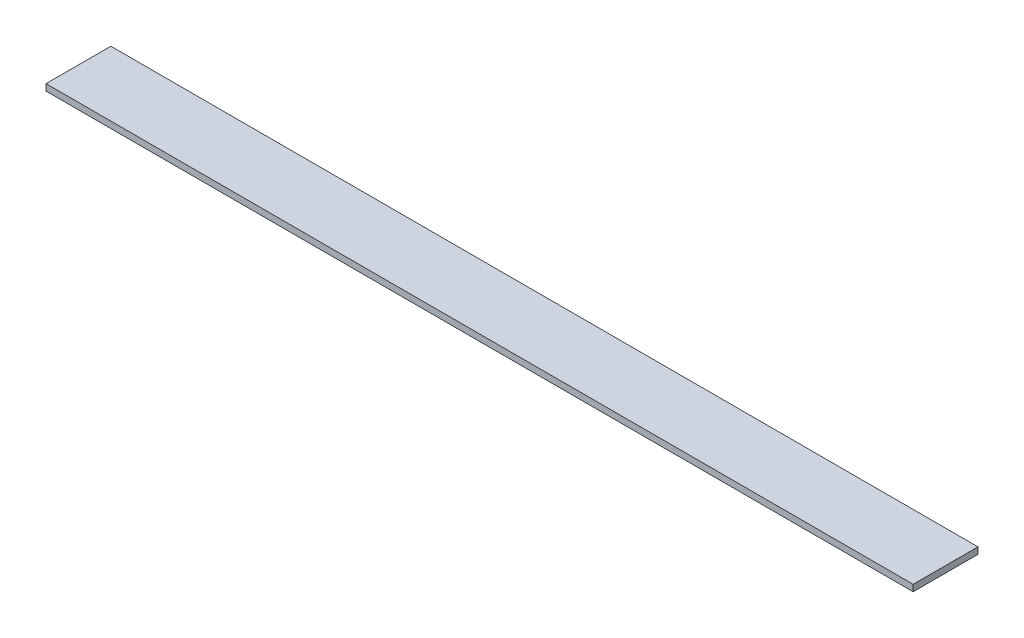
ISO-10303-21;
HEADER;
FILE_DESCRIPTION(('STEP AP214'),'2;1');
FILE_NAME('part.step','',(''),(''),'','','');
FILE_SCHEMA(('AUTOMOTIVE_DESIGN { 1 0 10303 214 1 1 1 1 }'));
ENDSEC;
DATA;
#1=APPLICATION_CONTEXT('core data for automotive mechanical design processes');
#2=APPLICATION_PROTOCOL_DEFINITION('international standard','automotive_design',2000,#1);
#3=PRODUCT_CONTEXT('',#1,'mechanical');
#4=PRODUCT('Part','Part','',(#3));
#5=PRODUCT_RELATED_PRODUCT_CATEGORY('part','',(#4));
#6=PRODUCT_DEFINITION_FORMATION('','',#4);
#7=PRODUCT_DEFINITION_CONTEXT('part definition',#1,'design');
#8=PRODUCT_DEFINITION('design','',#6,#7);
#9=PRODUCT_DEFINITION_SHAPE('','',#8);
#10=(LENGTH_UNIT() NAMED_UNIT(*) SI_UNIT(.MILLI.,.METRE.));
#11=(NAMED_UNIT(*) PLANE_ANGLE_UNIT() SI_UNIT($,.RADIAN.));
#12=(NAMED_UNIT(*) SI_UNIT($,.STERADIAN.) SOLID_ANGLE_UNIT());
#13=UNCERTAINTY_MEASURE_WITH_UNIT(LENGTH_MEASURE(1.E-05),#10,'distance_accuracy_value','');
#14=(GEOMETRIC_REPRESENTATION_CONTEXT(3) GLOBAL_UNCERTAINTY_ASSIGNED_CONTEXT((#13)) GLOBAL_UNIT_ASSIGNED_CONTEXT((#10,
#11,#12)) REPRESENTATION_CONTEXT('',''));
#15=CARTESIAN_POINT('',(0.,0.,0.));
#16=DIRECTION('',(0.,0.,1.));
#17=DIRECTION('',(1.,0.,0.));
#18=AXIS2_PLACEMENT_3D('',#15,#16,#17);
#19=CARTESIAN_POINT('',(1070.,0.,40.));
#20=DIRECTION('',(0.,0.,-1.));
#21=DIRECTION('',(-1.,0.,0.));
#22=AXIS2_PLACEMENT_3D('',#19,#20,#21);
#23=PLANE('',#22);
#24=DIRECTION('',(0.,-1.,0.));
#25=VECTOR('',#24,1.);
#26=CARTESIAN_POINT('',(0.,0.,40.));
#27=LINE('',#26,#25);
#28=CARTESIAN_POINT('',(0.,8.,40.));
#29=VERTEX_POINT('',#28);
#30=CARTESIAN_POINT('',(0.,0.,40.));
#31=VERTEX_POINT('',#30);
#32=EDGE_CURVE('E100',#29,#31,#27,.T.);
#33=ORIENTED_EDGE('',*,*,#32,.T.);
#34=DIRECTION('',(-1.,0.,0.));
#35=VECTOR('',#34,1.);
#36=CARTESIAN_POINT('',(1070.,0.,40.));
#37=LINE('',#36,#35);
#38=CARTESIAN_POINT('',(1070.,0.,40.));
#39=VERTEX_POINT('',#38);
#40=EDGE_CURVE('E11',#39,#31,#37,.T.);
#41=ORIENTED_EDGE('',*,*,#40,.F.);
#42=DIRECTION('',(0.,-1.,0.));
#43=VECTOR('',#42,1.);
#44=CARTESIAN_POINT('',(1070.,0.,40.));
#45=LINE('',#44,#43);
#46=CARTESIAN_POINT('',(1070.,8.,40.));
#47=VERTEX_POINT('',#46);
#48=EDGE_CURVE('E88',#47,#39,#45,.T.);
#49=ORIENTED_EDGE('',*,*,#48,.F.);
#50=DIRECTION('',(-1.,0.,0.));
#51=VECTOR('',#50,1.);
#52=CARTESIAN_POINT('',(1070.,8.,40.));
#53=LINE('',#52,#51);
#54=EDGE_CURVE('E96',#47,#29,#53,.T.);
#55=ORIENTED_EDGE('',*,*,#54,.T.);
#56=EDGE_LOOP('',(#33,#41,#49,#55));
#57=FACE_BOUND('',#56,.T.);
#58=ADVANCED_FACE('F37',(#57),#23,.F.);
#59=CARTESIAN_POINT('',(1070.,0.,40.));
#60=DIRECTION('',(0.,1.,0.));
#61=DIRECTION('',(0.,0.,1.));
#62=AXIS2_PLACEMENT_3D('',#59,#60,#61);
#63=PLANE('',#62);
#64=DIRECTION('',(0.,0.,-1.));
#65=VECTOR('',#64,1.);
#66=CARTESIAN_POINT('',(0.,0.,40.));
#67=LINE('',#66,#65);
#68=CARTESIAN_POINT('',(0.,0.,-40.));
#69=VERTEX_POINT('',#68);
#70=EDGE_CURVE('E92',#31,#69,#67,.T.);
#71=ORIENTED_EDGE('',*,*,#70,.T.);
#72=DIRECTION('',(-1.,0.,0.));
#73=VECTOR('',#72,1.);
#74=CARTESIAN_POINT('',(1070.,0.,-40.));
#75=LINE('',#74,#73);
#76=CARTESIAN_POINT('',(1070.,0.,-40.));
#77=VERTEX_POINT('',#76);
#78=EDGE_CURVE('E45',#77,#69,#75,.T.);
#79=ORIENTED_EDGE('',*,*,#78,.F.);
#80=DIRECTION('',(0.,0.,-1.));
#81=VECTOR('',#80,1.);
#82=CARTESIAN_POINT('',(1070.,0.,40.));
#83=LINE('',#82,#81);
#84=EDGE_CURVE('E83',#39,#77,#83,.T.);
#85=ORIENTED_EDGE('',*,*,#84,.F.);
#86=ORIENTED_EDGE('',*,*,#40,.T.);
#87=EDGE_LOOP('',(#71,#79,#85,#86));
#88=FACE_BOUND('',#87,.T.);
#89=ADVANCED_FACE('F91',(#88),#63,.F.);
#90=CARTESIAN_POINT('',(1070.,0.,-40.));
#91=DIRECTION('',(0.,0.,1.));
#92=DIRECTION('',(1.,0.,0.));
#93=AXIS2_PLACEMENT_3D('',#90,#91,#92);
#94=PLANE('',#93);
#95=DIRECTION('',(0.,1.,0.));
#96=VECTOR('',#95,1.);
#97=CARTESIAN_POINT('',(0.,0.,-40.));
#98=LINE('',#97,#96);
#99=CARTESIAN_POINT('',(0.,8.00000000000001,-40.));
#100=VERTEX_POINT('',#99);
#101=EDGE_CURVE('E70',#69,#100,#98,.T.);
#102=ORIENTED_EDGE('',*,*,#101,.T.);
#103=DIRECTION('',(-1.,0.,0.));
#104=VECTOR('',#103,1.);
#105=CARTESIAN_POINT('',(1070.,8.00000000000001,-40.));
#106=LINE('',#105,#104);
#107=CARTESIAN_POINT('',(1070.,8.00000000000001,-40.));
#108=VERTEX_POINT('',#107);
#109=EDGE_CURVE('E93',#108,#100,#106,.T.);
#110=ORIENTED_EDGE('',*,*,#109,.F.);
#111=DIRECTION('',(0.,1.,0.));
#112=VECTOR('',#111,1.);
#113=CARTESIAN_POINT('',(1070.,0.,-40.));
#114=LINE('',#113,#112);
#115=EDGE_CURVE('E86',#77,#108,#114,.T.);
#116=ORIENTED_EDGE('',*,*,#115,.F.);
#117=ORIENTED_EDGE('',*,*,#78,.T.);
#118=EDGE_LOOP('',(#102,#110,#116,#117));
#119=FACE_BOUND('',#118,.T.);
#120=ADVANCED_FACE('F94',(#119),#94,.F.);
#121=CARTESIAN_POINT('',(1070.,8.,40.));
#122=DIRECTION('',(0.,-1.,0.));
#123=DIRECTION('',(0.,0.,-1.));
#124=AXIS2_PLACEMENT_3D('',#121,#122,#123);
#125=PLANE('',#124);
#126=DIRECTION('',(0.,0.,1.));
#127=VECTOR('',#126,1.);
#128=CARTESIAN_POINT('',(0.,8.,40.));
#129=LINE('',#128,#127);
#130=EDGE_CURVE('E76',#100,#29,#129,.T.);
#131=ORIENTED_EDGE('',*,*,#130,.T.);
#132=ORIENTED_EDGE('',*,*,#54,.F.);
#133=DIRECTION('',(0.,0.,1.));
#134=VECTOR('',#133,1.);
#135=CARTESIAN_POINT('',(1070.,8.,40.));
#136=LINE('',#135,#134);
#137=EDGE_CURVE('E53',#108,#47,#136,.T.);
#138=ORIENTED_EDGE('',*,*,#137,.F.);
#139=ORIENTED_EDGE('',*,*,#109,.T.);
#140=EDGE_LOOP('',(#131,#132,#138,#139));
#141=FACE_BOUND('',#140,.T.);
#142=ADVANCED_FACE('F107',(#141),#125,.F.);
#143=CARTESIAN_POINT('',(1070.,0.,0.));
#144=DIRECTION('',(-1.,0.,0.));
#145=DIRECTION('',(0.,0.,1.));
#146=AXIS2_PLACEMENT_3D('',#143,#144,#145);
#147=PLANE('',#146);
#148=ORIENTED_EDGE('',*,*,#48,.T.);
#149=ORIENTED_EDGE('',*,*,#84,.T.);
#150=ORIENTED_EDGE('',*,*,#115,.T.);
#151=ORIENTED_EDGE('',*,*,#137,.T.);
#152=EDGE_LOOP('',(#148,#149,#150,#151));
#153=FACE_BOUND('',#152,.T.);
#154=ADVANCED_FACE('F84',(#153),#147,.F.);
#155=CARTESIAN_POINT('',(0.,0.,0.));
#156=DIRECTION('',(-1.,0.,0.));
#157=DIRECTION('',(0.,0.,1.));
#158=AXIS2_PLACEMENT_3D('',#155,#156,#157);
#159=PLANE('',#158);
#160=ORIENTED_EDGE('',*,*,#32,.F.);
#161=ORIENTED_EDGE('',*,*,#130,.F.);
#162=ORIENTED_EDGE('',*,*,#101,.F.);
#163=ORIENTED_EDGE('',*,*,#70,.F.);
#164=EDGE_LOOP('',(#160,#161,#162,#163));
#165=FACE_BOUND('',#164,.T.);
#166=ADVANCED_FACE('F110',(#165),#159,.T.);
#167=CLOSED_SHELL('',(#58,#89,#120,#142,#154,#166));
#168=MANIFOLD_SOLID_BREP('B2',#167);
#169=ADVANCED_BREP_SHAPE_REPRESENTATION('',(#18,#168),#14);
#170=SHAPE_DEFINITION_REPRESENTATION(#9,#169);
ENDSEC;
END-ISO-10303-21;
